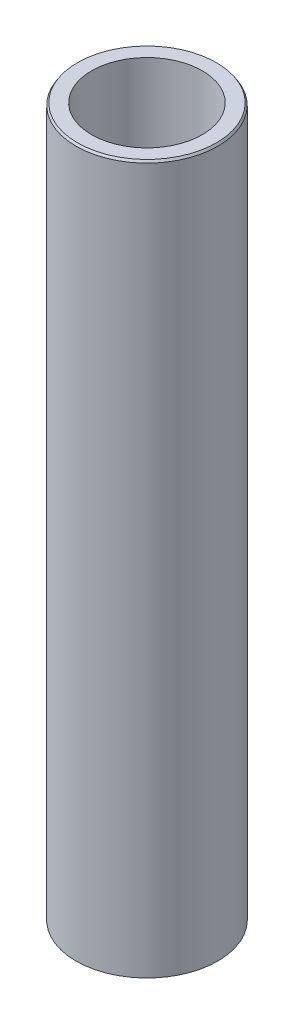
ISO-10303-21;
HEADER;
FILE_DESCRIPTION(('STEP AP214'),'2;1');
FILE_NAME('part.step','',(''),(''),'','','');
FILE_SCHEMA(('AUTOMOTIVE_DESIGN { 1 0 10303 214 1 1 1 1 }'));
ENDSEC;
DATA;
#1=APPLICATION_CONTEXT('core data for automotive mechanical design processes');
#2=APPLICATION_PROTOCOL_DEFINITION('international standard','automotive_design',2000,#1);
#3=PRODUCT_CONTEXT('',#1,'mechanical');
#4=PRODUCT('Part','Part','',(#3));
#5=PRODUCT_RELATED_PRODUCT_CATEGORY('part','',(#4));
#6=PRODUCT_DEFINITION_FORMATION('','',#4);
#7=PRODUCT_DEFINITION_CONTEXT('part definition',#1,'design');
#8=PRODUCT_DEFINITION('design','',#6,#7);
#9=PRODUCT_DEFINITION_SHAPE('','',#8);
#10=(LENGTH_UNIT() NAMED_UNIT(*) SI_UNIT(.MILLI.,.METRE.));
#11=(NAMED_UNIT(*) PLANE_ANGLE_UNIT() SI_UNIT($,.RADIAN.));
#12=(NAMED_UNIT(*) SI_UNIT($,.STERADIAN.) SOLID_ANGLE_UNIT());
#13=UNCERTAINTY_MEASURE_WITH_UNIT(LENGTH_MEASURE(1.E-05),#10,'distance_accuracy_value','');
#14=(GEOMETRIC_REPRESENTATION_CONTEXT(3) GLOBAL_UNCERTAINTY_ASSIGNED_CONTEXT((#13)) GLOBAL_UNIT_ASSIGNED_CONTEXT((#10,
#11,#12)) REPRESENTATION_CONTEXT('',''));
#15=CARTESIAN_POINT('',(0.,0.,0.));
#16=DIRECTION('',(0.,0.,1.));
#17=DIRECTION('',(1.,0.,0.));
#18=AXIS2_PLACEMENT_3D('',#15,#16,#17);
#19=CARTESIAN_POINT('',(0.,600.,0.));
#20=DIRECTION('',(0.,-1.,0.));
#21=DIRECTION('',(0.,0.,-1.));
#22=AXIS2_PLACEMENT_3D('',#19,#20,#21);
#23=CYLINDRICAL_SURFACE('',#22,60.);
#24=CARTESIAN_POINT('',(0.,598.146634518456,0.));
#25=DIRECTION('',(0.,1.,0.));
#26=DIRECTION('',(0.,0.,1.));
#27=AXIS2_PLACEMENT_3D('',#24,#25,#26);
#28=CIRCLE('',#27,60.);
#29=CARTESIAN_POINT('',(0.,598.146634518456,60.));
#30=VERTEX_POINT('',#29);
#31=EDGE_CURVE('E50',#30,#30,#28,.F.);
#32=ORIENTED_EDGE('',*,*,#31,.T.);
#33=EDGE_LOOP('',(#32));
#34=FACE_BOUND('',#33,.T.);
#35=CARTESIAN_POINT('',(0.,1.23321869588688,0.));
#36=DIRECTION('',(0.,1.,0.));
#37=DIRECTION('',(0.,0.,1.));
#38=AXIS2_PLACEMENT_3D('',#35,#36,#37);
#39=CIRCLE('',#38,60.);
#40=CARTESIAN_POINT('',(0.,1.23321869588688,60.));
#41=VERTEX_POINT('',#40);
#42=EDGE_CURVE('E51',#41,#41,#39,.T.);
#43=ORIENTED_EDGE('',*,*,#42,.T.);
#44=EDGE_LOOP('',(#43));
#45=FACE_BOUND('',#44,.T.);
#46=ADVANCED_FACE('F39',(#34,#45),#23,.T.);
#47=CARTESIAN_POINT('',(0.,600.,0.));
#48=DIRECTION('',(0.,1.,0.));
#49=DIRECTION('',(0.,0.,1.));
#50=AXIS2_PLACEMENT_3D('',#47,#48,#49);
#51=PLANE('',#50);
#52=CARTESIAN_POINT('',(0.,600.,0.));
#53=DIRECTION('',(0.,1.,0.));
#54=DIRECTION('',(0.,0.,1.));
#55=AXIS2_PLACEMENT_3D('',#52,#53,#54);
#56=CIRCLE('',#55,58.7667813041131);
#57=CARTESIAN_POINT('',(0.,600.,58.7667813041131));
#58=VERTEX_POINT('',#57);
#59=EDGE_CURVE('E54',#58,#58,#56,.T.);
#60=ORIENTED_EDGE('',*,*,#59,.T.);
#61=EDGE_LOOP('',(#60));
#62=FACE_BOUND('',#61,.T.);
#63=CARTESIAN_POINT('',(0.,600.,0.));
#64=DIRECTION('',(0.,1.,0.));
#65=DIRECTION('',(0.,0.,1.));
#66=AXIS2_PLACEMENT_3D('',#63,#64,#65);
#67=CIRCLE('',#66,46.8370512303237);
#68=CARTESIAN_POINT('',(0.,600.,46.8370512303237));
#69=VERTEX_POINT('',#68);
#70=EDGE_CURVE('E58',#69,#69,#67,.T.);
#71=ORIENTED_EDGE('',*,*,#70,.F.);
#72=EDGE_LOOP('',(#71));
#73=FACE_BOUND('',#72,.T.);
#74=ADVANCED_FACE('F69',(#62,#73),#51,.T.);
#75=CARTESIAN_POINT('',(0.,0.,0.));
#76=DIRECTION('',(0.,1.,0.));
#77=DIRECTION('',(0.,0.,1.));
#78=AXIS2_PLACEMENT_3D('',#75,#76,#77);
#79=PLANE('',#78);
#80=CARTESIAN_POINT('',(0.,0.,0.));
#81=DIRECTION('',(0.,1.,0.));
#82=DIRECTION('',(0.,0.,1.));
#83=AXIS2_PLACEMENT_3D('',#80,#81,#82);
#84=CIRCLE('',#83,58.1466345184559);
#85=CARTESIAN_POINT('',(0.,0.,58.1466345184559));
#86=VERTEX_POINT('',#85);
#87=EDGE_CURVE('E10',#86,#86,#84,.F.);
#88=ORIENTED_EDGE('',*,*,#87,.T.);
#89=EDGE_LOOP('',(#88));
#90=FACE_BOUND('',#89,.T.);
#91=CARTESIAN_POINT('',(0.,0.,0.));
#92=DIRECTION('',(0.,1.,0.));
#93=DIRECTION('',(0.,0.,1.));
#94=AXIS2_PLACEMENT_3D('',#91,#92,#93);
#95=CIRCLE('',#94,46.8370512303237);
#96=CARTESIAN_POINT('',(0.,0.,46.8370512303237));
#97=VERTEX_POINT('',#96);
#98=EDGE_CURVE('E63',#97,#97,#95,.T.);
#99=ORIENTED_EDGE('',*,*,#98,.T.);
#100=EDGE_LOOP('',(#99));
#101=FACE_BOUND('',#100,.T.);
#102=ADVANCED_FACE('F75',(#90,#101),#79,.F.);
#103=CARTESIAN_POINT('',(0.,600.,0.));
#104=DIRECTION('',(0.,-1.,0.));
#105=DIRECTION('',(0.,0.,-1.));
#106=AXIS2_PLACEMENT_3D('',#103,#104,#105);
#107=CYLINDRICAL_SURFACE('',#106,46.8370512303237);
#108=ORIENTED_EDGE('',*,*,#70,.T.);
#109=EDGE_LOOP('',(#108));
#110=FACE_BOUND('',#109,.T.);
#111=ORIENTED_EDGE('',*,*,#98,.F.);
#112=EDGE_LOOP('',(#111));
#113=FACE_BOUND('',#112,.T.);
#114=ADVANCED_FACE('F70',(#110,#113),#107,.F.);
#115=CARTESIAN_POINT('',(0.,600.,0.));
#116=DIRECTION('',(0.,-1.,0.));
#117=DIRECTION('',(0.,0.,-1.));
#118=AXIS2_PLACEMENT_3D('',#115,#116,#117);
#119=CONICAL_SURFACE('',#118,58.7667813041131,0.587121167832029);
#120=ORIENTED_EDGE('',*,*,#31,.F.);
#121=EDGE_LOOP('',(#120));
#122=FACE_BOUND('',#121,.T.);
#123=ORIENTED_EDGE('',*,*,#59,.F.);
#124=EDGE_LOOP('',(#123));
#125=FACE_BOUND('',#124,.T.);
#126=ADVANCED_FACE('F81',(#122,#125),#119,.T.);
#127=CARTESIAN_POINT('',(0.,1.23321869588688,0.));
#128=DIRECTION('',(0.,1.,0.));
#129=DIRECTION('',(0.,0.,1.));
#130=AXIS2_PLACEMENT_3D('',#127,#128,#129);
#131=CONICAL_SURFACE('',#130,60.,0.983675158962854);
#132=ORIENTED_EDGE('',*,*,#87,.F.);
#133=EDGE_LOOP('',(#132));
#134=FACE_BOUND('',#133,.T.);
#135=ORIENTED_EDGE('',*,*,#42,.F.);
#136=EDGE_LOOP('',(#135));
#137=FACE_BOUND('',#136,.T.);
#138=ADVANCED_FACE('F45',(#134,#137),#131,.T.);
#139=CLOSED_SHELL('',(#46,#74,#102,#114,#126,#138));
#140=MANIFOLD_SOLID_BREP('B2',#139);
#141=ADVANCED_BREP_SHAPE_REPRESENTATION('',(#18,#140),#14);
#142=SHAPE_DEFINITION_REPRESENTATION(#9,#141);
ENDSEC;
END-ISO-10303-21;
